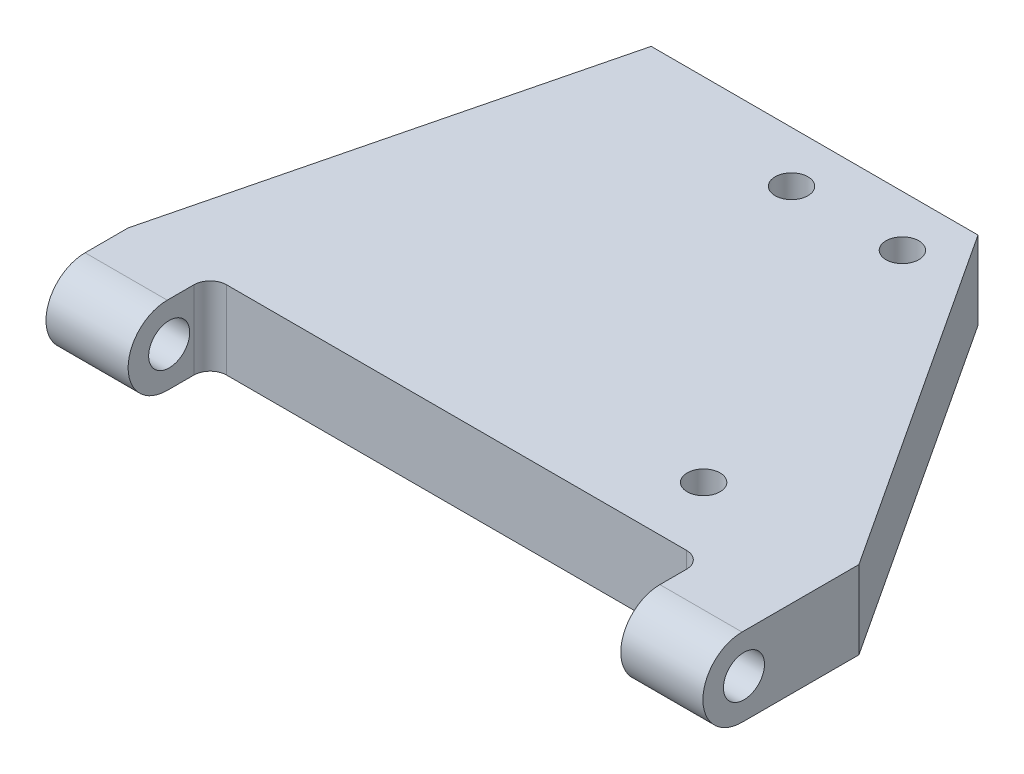
ISO-10303-21;
HEADER;
FILE_DESCRIPTION(('STEP AP214'),'2;1');
FILE_NAME('part.step','',(''),(''),'','','');
FILE_SCHEMA(('AUTOMOTIVE_DESIGN { 1 0 10303 214 1 1 1 1 }'));
ENDSEC;
DATA;
#1=APPLICATION_CONTEXT('core data for automotive mechanical design processes');
#2=APPLICATION_PROTOCOL_DEFINITION('international standard','automotive_design',2000,#1);
#3=PRODUCT_CONTEXT('',#1,'mechanical');
#4=PRODUCT('Part','Part','',(#3));
#5=PRODUCT_RELATED_PRODUCT_CATEGORY('part','',(#4));
#6=PRODUCT_DEFINITION_FORMATION('','',#4);
#7=PRODUCT_DEFINITION_CONTEXT('part definition',#1,'design');
#8=PRODUCT_DEFINITION('design','',#6,#7);
#9=PRODUCT_DEFINITION_SHAPE('','',#8);
#10=(LENGTH_UNIT() NAMED_UNIT(*) SI_UNIT(.MILLI.,.METRE.));
#11=(NAMED_UNIT(*) PLANE_ANGLE_UNIT() SI_UNIT($,.RADIAN.));
#12=(NAMED_UNIT(*) SI_UNIT($,.STERADIAN.) SOLID_ANGLE_UNIT());
#13=UNCERTAINTY_MEASURE_WITH_UNIT(LENGTH_MEASURE(1.E-05),#10,'distance_accuracy_value','');
#14=(GEOMETRIC_REPRESENTATION_CONTEXT(3) GLOBAL_UNCERTAINTY_ASSIGNED_CONTEXT((#13)) GLOBAL_UNIT_ASSIGNED_CONTEXT((#10,
#11,#12)) REPRESENTATION_CONTEXT('',''));
#15=CARTESIAN_POINT('',(0.,0.,0.));
#16=DIRECTION('',(0.,0.,1.));
#17=DIRECTION('',(1.,0.,0.));
#18=AXIS2_PLACEMENT_3D('',#15,#16,#17);
#19=CARTESIAN_POINT('',(140.,9.525,112.475));
#20=DIRECTION('',(1.,0.,0.));
#21=DIRECTION('',(0.,0.,-1.));
#22=AXIS2_PLACEMENT_3D('',#19,#20,#21);
#23=CYLINDRICAL_SURFACE('',#22,9.525);
#24=DIRECTION('',(-1.,0.,0.));
#25=VECTOR('',#24,1.);
#26=CARTESIAN_POINT('',(140.,19.05,112.475));
#27=LINE('',#26,#25);
#28=CARTESIAN_POINT('',(140.,19.05,112.475));
#29=VERTEX_POINT('',#28);
#30=CARTESIAN_POINT('',(160.,19.05,112.475));
#31=VERTEX_POINT('',#30);
#32=EDGE_CURVE('E295',#29,#31,#27,.F.);
#33=ORIENTED_EDGE('',*,*,#32,.F.);
#34=CARTESIAN_POINT('',(140.,9.525,112.475));
#35=DIRECTION('',(1.,0.,0.));
#36=DIRECTION('',(0.,0.,-1.));
#37=AXIS2_PLACEMENT_3D('',#34,#35,#36);
#38=CIRCLE('',#37,9.525);
#39=CARTESIAN_POINT('',(140.,0.,112.475));
#40=VERTEX_POINT('',#39);
#41=EDGE_CURVE('E120',#40,#29,#38,.F.);
#42=ORIENTED_EDGE('',*,*,#41,.F.);
#43=DIRECTION('',(1.,0.,0.));
#44=VECTOR('',#43,1.);
#45=CARTESIAN_POINT('',(0.,0.,112.475));
#46=LINE('',#45,#44);
#47=CARTESIAN_POINT('',(160.,0.,112.475));
#48=VERTEX_POINT('',#47);
#49=EDGE_CURVE('E298',#48,#40,#46,.F.);
#50=ORIENTED_EDGE('',*,*,#49,.F.);
#51=CARTESIAN_POINT('',(160.,9.525,112.475));
#52=DIRECTION('',(-1.,0.,0.));
#53=DIRECTION('',(0.,0.,1.));
#54=AXIS2_PLACEMENT_3D('',#51,#52,#53);
#55=CIRCLE('',#54,9.525);
#56=EDGE_CURVE('E12',#31,#48,#55,.F.);
#57=ORIENTED_EDGE('',*,*,#56,.F.);
#58=EDGE_LOOP('',(#33,#42,#50,#57));
#59=FACE_BOUND('',#58,.T.);
#60=ADVANCED_FACE('F112',(#59),#23,.T.);
#61=CARTESIAN_POINT('',(0.,9.525,112.475));
#62=DIRECTION('',(1.,0.,0.));
#63=DIRECTION('',(0.,0.,-1.));
#64=AXIS2_PLACEMENT_3D('',#61,#62,#63);
#65=CYLINDRICAL_SURFACE('',#64,9.525);
#66=DIRECTION('',(-1.,0.,0.));
#67=VECTOR('',#66,1.);
#68=CARTESIAN_POINT('',(0.,19.05,112.475));
#69=LINE('',#68,#67);
#70=CARTESIAN_POINT('',(0.,19.05,112.475));
#71=VERTEX_POINT('',#70);
#72=CARTESIAN_POINT('',(20.,19.05,112.475));
#73=VERTEX_POINT('',#72);
#74=EDGE_CURVE('E209',#71,#73,#69,.F.);
#75=ORIENTED_EDGE('',*,*,#74,.F.);
#76=CARTESIAN_POINT('',(0.,9.525,112.475));
#77=DIRECTION('',(1.,0.,0.));
#78=DIRECTION('',(0.,0.,-1.));
#79=AXIS2_PLACEMENT_3D('',#76,#77,#78);
#80=CIRCLE('',#79,9.525);
#81=CARTESIAN_POINT('',(0.,0.,112.475));
#82=VERTEX_POINT('',#81);
#83=EDGE_CURVE('E291',#82,#71,#80,.F.);
#84=ORIENTED_EDGE('',*,*,#83,.F.);
#85=DIRECTION('',(1.,0.,0.));
#86=VECTOR('',#85,1.);
#87=CARTESIAN_POINT('',(0.,0.,112.475));
#88=LINE('',#87,#86);
#89=CARTESIAN_POINT('',(20.,0.,112.475));
#90=VERTEX_POINT('',#89);
#91=EDGE_CURVE('E288',#90,#82,#88,.F.);
#92=ORIENTED_EDGE('',*,*,#91,.F.);
#93=CARTESIAN_POINT('',(20.,9.525,112.475));
#94=DIRECTION('',(1.,0.,0.));
#95=DIRECTION('',(0.,0.,-1.));
#96=AXIS2_PLACEMENT_3D('',#93,#94,#95);
#97=CIRCLE('',#96,9.525);
#98=EDGE_CURVE('E293',#73,#90,#97,.T.);
#99=ORIENTED_EDGE('',*,*,#98,.F.);
#100=EDGE_LOOP('',(#75,#84,#92,#99));
#101=FACE_BOUND('',#100,.T.);
#102=ADVANCED_FACE('F333',(#101),#65,.T.);
#103=CARTESIAN_POINT('',(0.,0.,0.));
#104=DIRECTION('',(0.,1.,0.));
#105=DIRECTION('',(0.,0.,1.));
#106=AXIS2_PLACEMENT_3D('',#103,#104,#105);
#107=PLANE('',#106);
#108=CARTESIAN_POINT('',(123.750569229122,0.,85.5773374277373));
#109=DIRECTION('',(0.,1.,0.));
#110=DIRECTION('',(0.,0.,1.));
#111=AXIS2_PLACEMENT_3D('',#108,#109,#110);
#112=CIRCLE('',#111,3.99999999999995);
#113=CARTESIAN_POINT('',(123.750569229122,0.,89.5773374277373));
#114=VERTEX_POINT('',#113);
#115=EDGE_CURVE('E438',#114,#114,#112,.T.);
#116=ORIENTED_EDGE('',*,*,#115,.T.);
#117=EDGE_LOOP('',(#116));
#118=FACE_BOUND('',#117,.T.);
#119=CARTESIAN_POINT('',(72.,0.,12.4141568321594));
#120=DIRECTION('',(0.,-1.,0.));
#121=DIRECTION('',(0.,0.,-1.));
#122=AXIS2_PLACEMENT_3D('',#119,#120,#121);
#123=CIRCLE('',#122,4.00000000000001);
#124=CARTESIAN_POINT('',(72.,0.,8.41415683215943));
#125=VERTEX_POINT('',#124);
#126=EDGE_CURVE('E447',#125,#125,#123,.T.);
#127=ORIENTED_EDGE('',*,*,#126,.F.);
#128=EDGE_LOOP('',(#127));
#129=FACE_BOUND('',#128,.T.);
#130=CARTESIAN_POINT('',(99.,0.,12.4141568321594));
#131=DIRECTION('',(0.,-1.,0.));
#132=DIRECTION('',(0.,0.,-1.));
#133=AXIS2_PLACEMENT_3D('',#130,#131,#132);
#134=CIRCLE('',#133,4.00000000000001);
#135=CARTESIAN_POINT('',(99.,0.,8.41415683215943));
#136=VERTEX_POINT('',#135);
#137=EDGE_CURVE('E397',#136,#136,#134,.T.);
#138=ORIENTED_EDGE('',*,*,#137,.F.);
#139=EDGE_LOOP('',(#138));
#140=FACE_BOUND('',#139,.T.);
#141=DIRECTION('',(0.,0.,-1.));
#142=VECTOR('',#141,1.);
#143=CARTESIAN_POINT('',(160.,0.,1.1686558153949E-13));
#144=LINE('',#143,#142);
#145=CARTESIAN_POINT('',(160.,0.,84.));
#146=VERTEX_POINT('',#145);
#147=EDGE_CURVE('E257',#48,#146,#144,.T.);
#148=ORIENTED_EDGE('',*,*,#147,.F.);
#149=ORIENTED_EDGE('',*,*,#49,.T.);
#150=DIRECTION('',(0.,0.,1.));
#151=VECTOR('',#150,1.);
#152=CARTESIAN_POINT('',(140.,0.,2.42861286636753E-13));
#153=LINE('',#152,#151);
#154=CARTESIAN_POINT('',(140.,0.,106.));
#155=VERTEX_POINT('',#154);
#156=EDGE_CURVE('E254',#155,#40,#153,.T.);
#157=ORIENTED_EDGE('',*,*,#156,.F.);
#158=CARTESIAN_POINT('',(136.,0.,106.));
#159=DIRECTION('',(0.,1.,0.));
#160=DIRECTION('',(0.,0.,1.));
#161=AXIS2_PLACEMENT_3D('',#158,#159,#160);
#162=CIRCLE('',#161,4.00000000000001);
#163=CARTESIAN_POINT('',(136.,0.,102.));
#164=VERTEX_POINT('',#163);
#165=EDGE_CURVE('E251',#164,#155,#162,.F.);
#166=ORIENTED_EDGE('',*,*,#165,.F.);
#167=DIRECTION('',(-1.,0.,0.));
#168=VECTOR('',#167,1.);
#169=CARTESIAN_POINT('',(0.,0.,102.));
#170=LINE('',#169,#168);
#171=CARTESIAN_POINT('',(24.,0.,102.));
#172=VERTEX_POINT('',#171);
#173=EDGE_CURVE('E248',#164,#172,#170,.T.);
#174=ORIENTED_EDGE('',*,*,#173,.T.);
#175=CARTESIAN_POINT('',(24.,0.,106.));
#176=DIRECTION('',(0.,1.,0.));
#177=DIRECTION('',(0.,0.,1.));
#178=AXIS2_PLACEMENT_3D('',#175,#176,#177);
#179=CIRCLE('',#178,4.00000000000001);
#180=CARTESIAN_POINT('',(20.,0.,106.));
#181=VERTEX_POINT('',#180);
#182=EDGE_CURVE('E204',#172,#181,#179,.T.);
#183=ORIENTED_EDGE('',*,*,#182,.T.);
#184=DIRECTION('',(0.,0.,1.));
#185=VECTOR('',#184,1.);
#186=CARTESIAN_POINT('',(20.,0.,0.));
#187=LINE('',#186,#185);
#188=EDGE_CURVE('E221',#181,#90,#187,.T.);
#189=ORIENTED_EDGE('',*,*,#188,.T.);
#190=ORIENTED_EDGE('',*,*,#91,.T.);
#191=DIRECTION('',(0.,0.,1.));
#192=VECTOR('',#191,1.);
#193=CARTESIAN_POINT('',(0.,0.,0.));
#194=LINE('',#193,#192);
#195=CARTESIAN_POINT('',(0.,0.,102.));
#196=VERTEX_POINT('',#195);
#197=EDGE_CURVE('E268',#196,#82,#194,.T.);
#198=ORIENTED_EDGE('',*,*,#197,.F.);
#199=DIRECTION('',(0.241640143717287,0.,-0.97036593146312));
#200=VECTOR('',#199,1.);
#201=CARTESIAN_POINT('',(23.9168950399849,0.,5.95577582368252));
#202=LINE('',#201,#200);
#203=CARTESIAN_POINT('',(25.4,0.,0.));
#204=VERTEX_POINT('',#203);
#205=EDGE_CURVE('E265',#196,#204,#202,.T.);
#206=ORIENTED_EDGE('',*,*,#205,.T.);
#207=DIRECTION('',(-1.,0.,0.));
#208=VECTOR('',#207,1.);
#209=CARTESIAN_POINT('',(0.,0.,0.));
#210=LINE('',#209,#208);
#211=CARTESIAN_POINT('',(105.,0.,0.));
#212=VERTEX_POINT('',#211);
#213=EDGE_CURVE('E262',#212,#204,#210,.T.);
#214=ORIENTED_EDGE('',*,*,#213,.F.);
#215=DIRECTION('',(0.547785941363776,0.,0.836618528628312));
#216=VECTOR('',#215,1.);
#217=CARTESIAN_POINT('',(73.4927090566412,0.,-48.1202261680389));
#218=LINE('',#217,#216);
#219=EDGE_CURVE('E259',#212,#146,#218,.T.);
#220=ORIENTED_EDGE('',*,*,#219,.T.);
#221=EDGE_LOOP('',(#148,#149,#157,#166,#174,#183,#189,#190,#198,#206,#214,#220));
#222=FACE_BOUND('',#221,.T.);
#223=ADVANCED_FACE('F307',(#118,#129,#140,#222),#107,.F.);
#224=CARTESIAN_POINT('',(140.,19.05,2.42861286636753E-13));
#225=DIRECTION('',(1.,0.,0.));
#226=DIRECTION('',(0.,0.,-1.));
#227=AXIS2_PLACEMENT_3D('',#224,#225,#226);
#228=PLANE('',#227);
#229=CARTESIAN_POINT('',(140.,9.525,112.));
#230=DIRECTION('',(1.,0.,0.));
#231=DIRECTION('',(0.,0.,-1.));
#232=AXIS2_PLACEMENT_3D('',#229,#230,#231);
#233=CIRCLE('',#232,5.);
#234=CARTESIAN_POINT('',(140.,9.525,107.));
#235=VERTEX_POINT('',#234);
#236=EDGE_CURVE('E391',#235,#235,#233,.T.);
#237=ORIENTED_EDGE('',*,*,#236,.T.);
#238=EDGE_LOOP('',(#237));
#239=FACE_BOUND('',#238,.T.);
#240=ORIENTED_EDGE('',*,*,#156,.T.);
#241=ORIENTED_EDGE('',*,*,#41,.T.);
#242=DIRECTION('',(0.,0.,1.));
#243=VECTOR('',#242,1.);
#244=CARTESIAN_POINT('',(140.,19.05,2.42861286636753E-13));
#245=LINE('',#244,#243);
#246=CARTESIAN_POINT('',(140.,19.05,106.));
#247=VERTEX_POINT('',#246);
#248=EDGE_CURVE('E227',#247,#29,#245,.T.);
#249=ORIENTED_EDGE('',*,*,#248,.F.);
#250=DIRECTION('',(0.,-1.,0.));
#251=VECTOR('',#250,1.);
#252=CARTESIAN_POINT('',(140.,19.05,106.));
#253=LINE('',#252,#251);
#254=EDGE_CURVE('E283',#247,#155,#253,.T.);
#255=ORIENTED_EDGE('',*,*,#254,.T.);
#256=EDGE_LOOP('',(#240,#241,#249,#255));
#257=FACE_BOUND('',#256,.T.);
#258=ADVANCED_FACE('F300',(#239,#257),#228,.F.);
#259=CARTESIAN_POINT('',(136.,19.05,106.));
#260=DIRECTION('',(0.,-1.,0.));
#261=DIRECTION('',(0.,0.,-1.));
#262=AXIS2_PLACEMENT_3D('',#259,#260,#261);
#263=CYLINDRICAL_SURFACE('',#262,4.00000000000001);
#264=ORIENTED_EDGE('',*,*,#165,.T.);
#265=ORIENTED_EDGE('',*,*,#254,.F.);
#266=CARTESIAN_POINT('',(136.,19.05,106.));
#267=DIRECTION('',(0.,1.,0.));
#268=DIRECTION('',(0.,0.,1.));
#269=AXIS2_PLACEMENT_3D('',#266,#267,#268);
#270=CIRCLE('',#269,4.00000000000001);
#271=CARTESIAN_POINT('',(136.,19.05,102.));
#272=VERTEX_POINT('',#271);
#273=EDGE_CURVE('E225',#272,#247,#270,.F.);
#274=ORIENTED_EDGE('',*,*,#273,.F.);
#275=DIRECTION('',(0.,-1.,0.));
#276=VECTOR('',#275,1.);
#277=CARTESIAN_POINT('',(136.,19.05,102.));
#278=LINE('',#277,#276);
#279=EDGE_CURVE('E210',#272,#164,#278,.T.);
#280=ORIENTED_EDGE('',*,*,#279,.T.);
#281=EDGE_LOOP('',(#264,#265,#274,#280));
#282=FACE_BOUND('',#281,.T.);
#283=ADVANCED_FACE('F303',(#282),#263,.F.);
#284=CARTESIAN_POINT('',(0.,19.05,102.));
#285=DIRECTION('',(0.,0.,1.));
#286=DIRECTION('',(1.,0.,0.));
#287=AXIS2_PLACEMENT_3D('',#284,#285,#286);
#288=PLANE('',#287);
#289=ORIENTED_EDGE('',*,*,#173,.F.);
#290=ORIENTED_EDGE('',*,*,#279,.F.);
#291=DIRECTION('',(-1.,0.,0.));
#292=VECTOR('',#291,1.);
#293=CARTESIAN_POINT('',(0.,19.05,102.));
#294=LINE('',#293,#292);
#295=CARTESIAN_POINT('',(24.,19.05,102.));
#296=VERTEX_POINT('',#295);
#297=EDGE_CURVE('E217',#272,#296,#294,.T.);
#298=ORIENTED_EDGE('',*,*,#297,.T.);
#299=DIRECTION('',(0.,-1.,0.));
#300=VECTOR('',#299,1.);
#301=CARTESIAN_POINT('',(24.,19.05,102.));
#302=LINE('',#301,#300);
#303=EDGE_CURVE('E198',#296,#172,#302,.T.);
#304=ORIENTED_EDGE('',*,*,#303,.T.);
#305=EDGE_LOOP('',(#289,#290,#298,#304));
#306=FACE_BOUND('',#305,.T.);
#307=ADVANCED_FACE('F223',(#306),#288,.T.);
#308=CARTESIAN_POINT('',(24.,19.05,106.));
#309=DIRECTION('',(0.,-1.,0.));
#310=DIRECTION('',(0.,0.,-1.));
#311=AXIS2_PLACEMENT_3D('',#308,#309,#310);
#312=CYLINDRICAL_SURFACE('',#311,4.00000000000001);
#313=ORIENTED_EDGE('',*,*,#182,.F.);
#314=ORIENTED_EDGE('',*,*,#303,.F.);
#315=CARTESIAN_POINT('',(24.,19.05,106.));
#316=DIRECTION('',(0.,1.,0.));
#317=DIRECTION('',(0.,0.,1.));
#318=AXIS2_PLACEMENT_3D('',#315,#316,#317);
#319=CIRCLE('',#318,4.00000000000001);
#320=CARTESIAN_POINT('',(20.,19.05,106.));
#321=VERTEX_POINT('',#320);
#322=EDGE_CURVE('E201',#296,#321,#319,.T.);
#323=ORIENTED_EDGE('',*,*,#322,.T.);
#324=DIRECTION('',(0.,-1.,0.));
#325=VECTOR('',#324,1.);
#326=CARTESIAN_POINT('',(20.,19.05,106.));
#327=LINE('',#326,#325);
#328=EDGE_CURVE('E246',#321,#181,#327,.T.);
#329=ORIENTED_EDGE('',*,*,#328,.T.);
#330=EDGE_LOOP('',(#313,#314,#323,#329));
#331=FACE_BOUND('',#330,.T.);
#332=ADVANCED_FACE('F200',(#331),#312,.F.);
#333=CARTESIAN_POINT('',(20.,19.05,0.));
#334=DIRECTION('',(1.,0.,0.));
#335=DIRECTION('',(0.,0.,-1.));
#336=AXIS2_PLACEMENT_3D('',#333,#334,#335);
#337=PLANE('',#336);
#338=CARTESIAN_POINT('',(20.,9.525,112.));
#339=DIRECTION('',(1.,0.,0.));
#340=DIRECTION('',(0.,0.,-1.));
#341=AXIS2_PLACEMENT_3D('',#338,#339,#340);
#342=CIRCLE('',#341,5.);
#343=CARTESIAN_POINT('',(20.,9.525,107.));
#344=VERTEX_POINT('',#343);
#345=EDGE_CURVE('E387',#344,#344,#342,.T.);
#346=ORIENTED_EDGE('',*,*,#345,.F.);
#347=EDGE_LOOP('',(#346));
#348=FACE_BOUND('',#347,.T.);
#349=DIRECTION('',(0.,0.,1.));
#350=VECTOR('',#349,1.);
#351=CARTESIAN_POINT('',(20.,19.05,0.));
#352=LINE('',#351,#350);
#353=EDGE_CURVE('E220',#321,#73,#352,.T.);
#354=ORIENTED_EDGE('',*,*,#353,.T.);
#355=ORIENTED_EDGE('',*,*,#98,.T.);
#356=ORIENTED_EDGE('',*,*,#188,.F.);
#357=ORIENTED_EDGE('',*,*,#328,.F.);
#358=EDGE_LOOP('',(#354,#355,#356,#357));
#359=FACE_BOUND('',#358,.T.);
#360=ADVANCED_FACE('F330',(#348,#359),#337,.T.);
#361=CARTESIAN_POINT('',(0.,19.05,0.));
#362=DIRECTION('',(1.,0.,0.));
#363=DIRECTION('',(0.,0.,-1.));
#364=AXIS2_PLACEMENT_3D('',#361,#362,#363);
#365=PLANE('',#364);
#366=CARTESIAN_POINT('',(0.,9.525,112.));
#367=DIRECTION('',(-1.,0.,0.));
#368=DIRECTION('',(0.,0.,1.));
#369=AXIS2_PLACEMENT_3D('',#366,#367,#368);
#370=CIRCLE('',#369,5.);
#371=CARTESIAN_POINT('',(0.,9.525,117.));
#372=VERTEX_POINT('',#371);
#373=EDGE_CURVE('E388',#372,#372,#370,.T.);
#374=ORIENTED_EDGE('',*,*,#373,.F.);
#375=EDGE_LOOP('',(#374));
#376=FACE_BOUND('',#375,.T.);
#377=ORIENTED_EDGE('',*,*,#197,.T.);
#378=ORIENTED_EDGE('',*,*,#83,.T.);
#379=DIRECTION('',(0.,0.,1.));
#380=VECTOR('',#379,1.);
#381=CARTESIAN_POINT('',(0.,19.05,0.));
#382=LINE('',#381,#380);
#383=CARTESIAN_POINT('',(0.,19.05,102.));
#384=VERTEX_POINT('',#383);
#385=EDGE_CURVE('E242',#384,#71,#382,.T.);
#386=ORIENTED_EDGE('',*,*,#385,.F.);
#387=DIRECTION('',(0.,-1.,0.));
#388=VECTOR('',#387,1.);
#389=CARTESIAN_POINT('',(0.,19.05,102.));
#390=LINE('',#389,#388);
#391=EDGE_CURVE('E274',#384,#196,#390,.T.);
#392=ORIENTED_EDGE('',*,*,#391,.T.);
#393=EDGE_LOOP('',(#377,#378,#386,#392));
#394=FACE_BOUND('',#393,.T.);
#395=ADVANCED_FACE('F326',(#376,#394),#365,.F.);
#396=CARTESIAN_POINT('',(23.9168950399849,19.05,5.95577582368252));
#397=DIRECTION('',(-0.97036593146312,0.,-0.241640143717287));
#398=DIRECTION('',(-0.241640143717287,0.,0.97036593146312));
#399=AXIS2_PLACEMENT_3D('',#396,#397,#398);
#400=PLANE('',#399);
#401=ORIENTED_EDGE('',*,*,#205,.F.);
#402=ORIENTED_EDGE('',*,*,#391,.F.);
#403=DIRECTION('',(0.241640143717287,0.,-0.97036593146312));
#404=VECTOR('',#403,1.);
#405=CARTESIAN_POINT('',(23.9168950399849,19.05,5.95577582368252));
#406=LINE('',#405,#404);
#407=CARTESIAN_POINT('',(25.4,19.05,0.));
#408=VERTEX_POINT('',#407);
#409=EDGE_CURVE('E239',#384,#408,#406,.T.);
#410=ORIENTED_EDGE('',*,*,#409,.T.);
#411=DIRECTION('',(0.,-1.,0.));
#412=VECTOR('',#411,1.);
#413=CARTESIAN_POINT('',(25.4,19.05,0.));
#414=LINE('',#413,#412);
#415=EDGE_CURVE('E276',#408,#204,#414,.T.);
#416=ORIENTED_EDGE('',*,*,#415,.T.);
#417=EDGE_LOOP('',(#401,#402,#410,#416));
#418=FACE_BOUND('',#417,.T.);
#419=ADVANCED_FACE('F322',(#418),#400,.T.);
#420=CARTESIAN_POINT('',(0.,19.05,0.));
#421=DIRECTION('',(0.,0.,1.));
#422=DIRECTION('',(1.,0.,0.));
#423=AXIS2_PLACEMENT_3D('',#420,#421,#422);
#424=PLANE('',#423);
#425=CARTESIAN_POINT('',(34.925,9.525,0.));
#426=DIRECTION('',(0.,0.,-1.));
#427=DIRECTION('',(-1.,0.,0.));
#428=AXIS2_PLACEMENT_3D('',#425,#426,#427);
#429=CIRCLE('',#428,3.96875);
#430=CARTESIAN_POINT('',(30.95625,9.525,0.));
#431=VERTEX_POINT('',#430);
#432=EDGE_CURVE('E401',#431,#431,#429,.T.);
#433=ORIENTED_EDGE('',*,*,#432,.F.);
#434=EDGE_LOOP('',(#433));
#435=FACE_BOUND('',#434,.T.);
#436=ORIENTED_EDGE('',*,*,#213,.T.);
#437=ORIENTED_EDGE('',*,*,#415,.F.);
#438=DIRECTION('',(-1.,0.,0.));
#439=VECTOR('',#438,1.);
#440=CARTESIAN_POINT('',(0.,19.05,0.));
#441=LINE('',#440,#439);
#442=CARTESIAN_POINT('',(105.,19.05,0.));
#443=VERTEX_POINT('',#442);
#444=EDGE_CURVE('E237',#443,#408,#441,.T.);
#445=ORIENTED_EDGE('',*,*,#444,.F.);
#446=DIRECTION('',(0.,-1.,0.));
#447=VECTOR('',#446,1.);
#448=CARTESIAN_POINT('',(105.,19.05,0.));
#449=LINE('',#448,#447);
#450=EDGE_CURVE('E278',#443,#212,#449,.T.);
#451=ORIENTED_EDGE('',*,*,#450,.T.);
#452=EDGE_LOOP('',(#436,#437,#445,#451));
#453=FACE_BOUND('',#452,.T.);
#454=ADVANCED_FACE('F319',(#435,#453),#424,.F.);
#455=CARTESIAN_POINT('',(73.4927090566412,19.05,-48.1202261680389));
#456=DIRECTION('',(0.836618528628312,0.,-0.547785941363776));
#457=DIRECTION('',(-0.547785941363776,0.,-0.836618528628312));
#458=AXIS2_PLACEMENT_3D('',#455,#456,#457);
#459=PLANE('',#458);
#460=ORIENTED_EDGE('',*,*,#219,.F.);
#461=ORIENTED_EDGE('',*,*,#450,.F.);
#462=DIRECTION('',(0.547785941363776,0.,0.836618528628312));
#463=VECTOR('',#462,1.);
#464=CARTESIAN_POINT('',(73.4927090566412,19.05,-48.1202261680389));
#465=LINE('',#464,#463);
#466=CARTESIAN_POINT('',(160.,19.05,84.));
#467=VERTEX_POINT('',#466);
#468=EDGE_CURVE('E234',#443,#467,#465,.T.);
#469=ORIENTED_EDGE('',*,*,#468,.T.);
#470=DIRECTION('',(0.,-1.,0.));
#471=VECTOR('',#470,1.);
#472=CARTESIAN_POINT('',(160.,19.05,84.));
#473=LINE('',#472,#471);
#474=EDGE_CURVE('E280',#467,#146,#473,.T.);
#475=ORIENTED_EDGE('',*,*,#474,.T.);
#476=EDGE_LOOP('',(#460,#461,#469,#475));
#477=FACE_BOUND('',#476,.T.);
#478=ADVANCED_FACE('F313',(#477),#459,.T.);
#479=CARTESIAN_POINT('',(160.,19.05,1.1686558153949E-13));
#480=DIRECTION('',(-1.,0.,0.));
#481=DIRECTION('',(0.,0.,1.));
#482=AXIS2_PLACEMENT_3D('',#479,#480,#481);
#483=PLANE('',#482);
#484=CARTESIAN_POINT('',(160.,9.525,112.));
#485=DIRECTION('',(-1.,0.,0.));
#486=DIRECTION('',(0.,0.,1.));
#487=AXIS2_PLACEMENT_3D('',#484,#485,#486);
#488=CIRCLE('',#487,5.);
#489=CARTESIAN_POINT('',(160.,9.525,117.));
#490=VERTEX_POINT('',#489);
#491=EDGE_CURVE('E385',#490,#490,#488,.T.);
#492=ORIENTED_EDGE('',*,*,#491,.T.);
#493=EDGE_LOOP('',(#492));
#494=FACE_BOUND('',#493,.T.);
#495=DIRECTION('',(0.,0.,-1.));
#496=VECTOR('',#495,1.);
#497=CARTESIAN_POINT('',(160.,19.05,1.1686558153949E-13));
#498=LINE('',#497,#496);
#499=EDGE_CURVE('E232',#31,#467,#498,.T.);
#500=ORIENTED_EDGE('',*,*,#499,.F.);
#501=ORIENTED_EDGE('',*,*,#56,.T.);
#502=ORIENTED_EDGE('',*,*,#147,.T.);
#503=ORIENTED_EDGE('',*,*,#474,.F.);
#504=EDGE_LOOP('',(#500,#501,#502,#503));
#505=FACE_BOUND('',#504,.T.);
#506=ADVANCED_FACE('F311',(#494,#505),#483,.F.);
#507=CARTESIAN_POINT('',(0.,19.05,0.));
#508=DIRECTION('',(0.,1.,0.));
#509=DIRECTION('',(0.,0.,1.));
#510=AXIS2_PLACEMENT_3D('',#507,#508,#509);
#511=PLANE('',#510);
#512=CARTESIAN_POINT('',(123.750569229122,19.05,85.5773374277373));
#513=DIRECTION('',(0.,1.,0.));
#514=DIRECTION('',(0.,0.,1.));
#515=AXIS2_PLACEMENT_3D('',#512,#513,#514);
#516=CIRCLE('',#515,3.99999999999995);
#517=CARTESIAN_POINT('',(123.750569229122,19.05,89.5773374277373));
#518=VERTEX_POINT('',#517);
#519=EDGE_CURVE('E441',#518,#518,#516,.T.);
#520=ORIENTED_EDGE('',*,*,#519,.F.);
#521=EDGE_LOOP('',(#520));
#522=FACE_BOUND('',#521,.T.);
#523=CARTESIAN_POINT('',(72.,19.05,12.4141568321594));
#524=DIRECTION('',(0.,-1.,0.));
#525=DIRECTION('',(0.,0.,-1.));
#526=AXIS2_PLACEMENT_3D('',#523,#524,#525);
#527=CIRCLE('',#526,4.00000000000001);
#528=CARTESIAN_POINT('',(72.,19.05,8.41415683215943));
#529=VERTEX_POINT('',#528);
#530=EDGE_CURVE('E394',#529,#529,#527,.T.);
#531=ORIENTED_EDGE('',*,*,#530,.T.);
#532=EDGE_LOOP('',(#531));
#533=FACE_BOUND('',#532,.T.);
#534=CARTESIAN_POINT('',(99.,19.05,12.4141568321594));
#535=DIRECTION('',(0.,-1.,0.));
#536=DIRECTION('',(0.,0.,-1.));
#537=AXIS2_PLACEMENT_3D('',#534,#535,#536);
#538=CIRCLE('',#537,4.00000000000001);
#539=CARTESIAN_POINT('',(99.,19.05,8.41415683215943));
#540=VERTEX_POINT('',#539);
#541=EDGE_CURVE('E449',#540,#540,#538,.T.);
#542=ORIENTED_EDGE('',*,*,#541,.T.);
#543=EDGE_LOOP('',(#542));
#544=FACE_BOUND('',#543,.T.);
#545=ORIENTED_EDGE('',*,*,#248,.T.);
#546=ORIENTED_EDGE('',*,*,#32,.T.);
#547=ORIENTED_EDGE('',*,*,#499,.T.);
#548=ORIENTED_EDGE('',*,*,#468,.F.);
#549=ORIENTED_EDGE('',*,*,#444,.T.);
#550=ORIENTED_EDGE('',*,*,#409,.F.);
#551=ORIENTED_EDGE('',*,*,#385,.T.);
#552=ORIENTED_EDGE('',*,*,#74,.T.);
#553=ORIENTED_EDGE('',*,*,#353,.F.);
#554=ORIENTED_EDGE('',*,*,#322,.F.);
#555=ORIENTED_EDGE('',*,*,#297,.F.);
#556=ORIENTED_EDGE('',*,*,#273,.T.);
#557=EDGE_LOOP('',(#545,#546,#547,#548,#549,#550,#551,#552,#553,#554,#555,#556));
#558=FACE_BOUND('',#557,.T.);
#559=ADVANCED_FACE('F215',(#522,#533,#544,#558),#511,.T.);
#560=CARTESIAN_POINT('',(34.925,9.525,38.1));
#561=DIRECTION('',(0.,0.,-1.));
#562=DIRECTION('',(-1.,0.,0.));
#563=AXIS2_PLACEMENT_3D('',#560,#561,#562);
#564=CYLINDRICAL_SURFACE('',#563,3.96875);
#565=CARTESIAN_POINT('',(34.925,9.525,38.1));
#566=DIRECTION('',(0.,0.,-1.));
#567=DIRECTION('',(-1.,0.,0.));
#568=AXIS2_PLACEMENT_3D('',#565,#566,#567);
#569=CIRCLE('',#568,3.96875);
#570=CARTESIAN_POINT('',(30.95625,9.525,38.1));
#571=VERTEX_POINT('',#570);
#572=EDGE_CURVE('E249',#571,#571,#569,.T.);
#573=CARTESIAN_POINT('',(30.95625,9.525,38.1));
#574=CARTESIAN_POINT('',(30.95625,9.525,37.703125));
#575=CARTESIAN_POINT('',(30.95625,9.525,37.30625));
#576=CARTESIAN_POINT('',(30.95625,9.525,36.5125));
#577=CARTESIAN_POINT('',(30.95625,9.525,36.115625));
#578=CARTESIAN_POINT('',(30.95625,9.525,35.321875));
#579=CARTESIAN_POINT('',(30.95625,9.525,34.925));
#580=CARTESIAN_POINT('',(30.95625,9.525,34.13125));
#581=CARTESIAN_POINT('',(30.95625,9.525,33.734375));
#582=CARTESIAN_POINT('',(30.95625,9.525,32.940625));
#583=CARTESIAN_POINT('',(30.95625,9.525,32.54375));
#584=CARTESIAN_POINT('',(30.95625,9.525,31.75));
#585=CARTESIAN_POINT('',(30.95625,9.525,31.353125));
#586=CARTESIAN_POINT('',(30.95625,9.525,30.559375));
#587=CARTESIAN_POINT('',(30.95625,9.525,30.1625));
#588=CARTESIAN_POINT('',(30.95625,9.525,29.36875));
#589=CARTESIAN_POINT('',(30.95625,9.525,28.971875));
#590=CARTESIAN_POINT('',(30.95625,9.525,28.178125));
#591=CARTESIAN_POINT('',(30.95625,9.525,27.78125));
#592=CARTESIAN_POINT('',(30.95625,9.525,26.9875));
#593=CARTESIAN_POINT('',(30.95625,9.525,26.590625));
#594=CARTESIAN_POINT('',(30.95625,9.525,25.796875));
#595=CARTESIAN_POINT('',(30.95625,9.525,25.4));
#596=CARTESIAN_POINT('',(30.95625,9.525,24.60625));
#597=CARTESIAN_POINT('',(30.95625,9.525,24.209375));
#598=CARTESIAN_POINT('',(30.95625,9.525,23.415625));
#599=CARTESIAN_POINT('',(30.95625,9.525,23.01875));
#600=CARTESIAN_POINT('',(30.95625,9.525,22.225));
#601=CARTESIAN_POINT('',(30.95625,9.525,21.828125));
#602=CARTESIAN_POINT('',(30.95625,9.525,21.034375));
#603=CARTESIAN_POINT('',(30.95625,9.525,20.6375));
#604=CARTESIAN_POINT('',(30.95625,9.525,19.84375));
#605=CARTESIAN_POINT('',(30.95625,9.525,19.446875));
#606=CARTESIAN_POINT('',(30.95625,9.525,18.653125));
#607=CARTESIAN_POINT('',(30.95625,9.525,18.25625));
#608=CARTESIAN_POINT('',(30.95625,9.525,17.4625));
#609=CARTESIAN_POINT('',(30.95625,9.525,17.065625));
#610=CARTESIAN_POINT('',(30.95625,9.525,16.271875));
#611=CARTESIAN_POINT('',(30.95625,9.525,15.875));
#612=CARTESIAN_POINT('',(30.95625,9.525,15.08125));
#613=CARTESIAN_POINT('',(30.95625,9.525,14.684375));
#614=CARTESIAN_POINT('',(30.95625,9.525,13.890625));
#615=CARTESIAN_POINT('',(30.95625,9.525,13.49375));
#616=CARTESIAN_POINT('',(30.95625,9.525,12.7));
#617=CARTESIAN_POINT('',(30.95625,9.525,12.303125));
#618=CARTESIAN_POINT('',(30.95625,9.525,11.509375));
#619=CARTESIAN_POINT('',(30.95625,9.525,11.1125));
#620=CARTESIAN_POINT('',(30.95625,9.525,10.31875));
#621=CARTESIAN_POINT('',(30.95625,9.525,9.92187499999999));
#622=CARTESIAN_POINT('',(30.95625,9.525,9.128125));
#623=CARTESIAN_POINT('',(30.95625,9.525,8.73124999999999));
#624=CARTESIAN_POINT('',(30.95625,9.525,7.93749999999999));
#625=CARTESIAN_POINT('',(30.95625,9.525,7.54062499999999));
#626=CARTESIAN_POINT('',(30.95625,9.525,6.74687499999999));
#627=CARTESIAN_POINT('',(30.95625,9.525,6.35));
#628=CARTESIAN_POINT('',(30.95625,9.525,5.55625));
#629=CARTESIAN_POINT('',(30.95625,9.525,5.159375));
#630=CARTESIAN_POINT('',(30.95625,9.525,4.365625));
#631=CARTESIAN_POINT('',(30.95625,9.525,3.96875));
#632=CARTESIAN_POINT('',(30.95625,9.525,3.17499999999999));
#633=CARTESIAN_POINT('',(30.95625,9.525,2.77812499999999));
#634=CARTESIAN_POINT('',(30.95625,9.525,1.98437499999999));
#635=CARTESIAN_POINT('',(30.95625,9.525,1.58749999999999));
#636=CARTESIAN_POINT('',(30.95625,9.525,0.793749999999994));
#637=CARTESIAN_POINT('',(30.95625,9.525,0.396874999999993));
#638=CARTESIAN_POINT('',(30.95625,9.525,0.));
#639=B_SPLINE_CURVE_WITH_KNOTS('',3,(#573,#574,#575,#576,#577,#578,#579,#580,#581,#582,#583,
#584,#585,#586,#587,#588,#589,#590,#591,#592,#593,#594,#595,#596,#597,#598,#599,#600,#601,#602,
#603,#604,#605,#606,#607,#608,#609,#610,#611,#612,#613,#614,#615,#616,#617,#618,#619,#620,#621,
#622,#623,#624,#625,#626,#627,#628,#629,#630,#631,#632,#633,#634,#635,#636,#637,#638),
.UNSPECIFIED.,.F.,.F.,(4,2,2,2,2,2,2,2,2,2,2,2,2,2,2,2,2,2,2,2,2,2,2,2,2,2,2,2,2,2,2,2,4),(0.,
1.19062499999999,2.38124999999999,3.571875,4.7625,5.953125,7.14375,8.334375,9.525,10.715625,
11.90625,13.096875,14.2875,15.478125,16.66875,17.859375,19.05,20.240625,21.43125,22.621875,
23.8125,25.003125,26.19375,27.384375,28.575,29.765625,30.95625,32.146875,33.3375,34.528125,
35.71875,36.909375,38.1),.UNSPECIFIED.);
#640=EDGE_CURVE('BSEAM381',#571,#431,#639,.T.);
#641=ORIENTED_EDGE('',*,*,#572,.F.);
#642=ORIENTED_EDGE('',*,*,#432,.T.);
#643=ORIENTED_EDGE('',*,*,#640,.T.);
#644=ORIENTED_EDGE('',*,*,#640,.F.);
#645=EDGE_LOOP('',(#641,#643,#642,#644));
#646=FACE_BOUND('',#645,.T.);
#647=ADVANCED_FACE('F381',(#646),#564,.F.);
#648=CARTESIAN_POINT('',(34.925,9.525,38.1));
#649=DIRECTION('',(0.,0.,-1.));
#650=DIRECTION('',(-1.,0.,0.));
#651=AXIS2_PLACEMENT_3D('',#648,#649,#650);
#652=PLANE('',#651);
#653=ORIENTED_EDGE('',*,*,#572,.T.);
#654=EDGE_LOOP('',(#653));
#655=FACE_BOUND('',#654,.T.);
#656=ADVANCED_FACE('F407',(#655),#652,.T.);
#657=CARTESIAN_POINT('',(160.,9.525,112.));
#658=DIRECTION('',(-1.,0.,0.));
#659=DIRECTION('',(0.,0.,1.));
#660=AXIS2_PLACEMENT_3D('',#657,#658,#659);
#661=CYLINDRICAL_SURFACE('',#660,5.);
#662=ORIENTED_EDGE('',*,*,#491,.F.);
#663=EDGE_LOOP('',(#662));
#664=FACE_BOUND('',#663,.T.);
#665=ORIENTED_EDGE('',*,*,#236,.F.);
#666=EDGE_LOOP('',(#665));
#667=FACE_BOUND('',#666,.T.);
#668=ADVANCED_FACE('F413',(#664,#667),#661,.F.);
#669=ORIENTED_EDGE('',*,*,#345,.T.);
#670=EDGE_LOOP('',(#669));
#671=FACE_BOUND('',#670,.T.);
#672=ORIENTED_EDGE('',*,*,#373,.T.);
#673=EDGE_LOOP('',(#672));
#674=FACE_BOUND('',#673,.T.);
#675=ADVANCED_FACE('F418',(#671,#674),#661,.F.);
#676=CARTESIAN_POINT('',(99.,19.05,12.4141568321594));
#677=DIRECTION('',(0.,-1.,0.));
#678=DIRECTION('',(0.,0.,-1.));
#679=AXIS2_PLACEMENT_3D('',#676,#677,#678);
#680=CYLINDRICAL_SURFACE('',#679,4.00000000000001);
#681=CARTESIAN_POINT('',(99.,19.05,8.41415683215943));
#682=CARTESIAN_POINT('',(99.,18.8515625,8.41415683215943));
#683=CARTESIAN_POINT('',(99.,18.653125,8.41415683215943));
#684=CARTESIAN_POINT('',(99.,18.25625,8.41415683215943));
#685=CARTESIAN_POINT('',(99.,18.0578125,8.41415683215943));
#686=CARTESIAN_POINT('',(99.,17.6609375,8.41415683215943));
#687=CARTESIAN_POINT('',(99.,17.4625,8.41415683215943));
#688=CARTESIAN_POINT('',(99.,17.065625,8.41415683215943));
#689=CARTESIAN_POINT('',(99.,16.8671875,8.41415683215943));
#690=CARTESIAN_POINT('',(99.,16.4703125,8.41415683215943));
#691=CARTESIAN_POINT('',(99.,16.271875,8.41415683215943));
#692=CARTESIAN_POINT('',(99.,15.875,8.41415683215943));
#693=CARTESIAN_POINT('',(99.,15.6765625,8.41415683215943));
#694=CARTESIAN_POINT('',(99.,15.2796875,8.41415683215943));
#695=CARTESIAN_POINT('',(99.,15.08125,8.41415683215943));
#696=CARTESIAN_POINT('',(99.,14.684375,8.41415683215943));
#697=CARTESIAN_POINT('',(99.,14.4859375,8.41415683215943));
#698=CARTESIAN_POINT('',(99.,14.0890625,8.41415683215943));
#699=CARTESIAN_POINT('',(99.,13.890625,8.41415683215943));
#700=CARTESIAN_POINT('',(99.,13.49375,8.41415683215943));
#701=CARTESIAN_POINT('',(99.,13.2953125,8.41415683215943));
#702=CARTESIAN_POINT('',(99.,12.8984375,8.41415683215943));
#703=CARTESIAN_POINT('',(99.,12.7,8.41415683215943));
#704=CARTESIAN_POINT('',(99.,12.303125,8.41415683215943));
#705=CARTESIAN_POINT('',(99.,12.1046875,8.41415683215943));
#706=CARTESIAN_POINT('',(99.,11.7078125,8.41415683215943));
#707=CARTESIAN_POINT('',(99.,11.509375,8.41415683215943));
#708=CARTESIAN_POINT('',(99.,11.1125,8.41415683215943));
#709=CARTESIAN_POINT('',(99.,10.9140625,8.41415683215943));
#710=CARTESIAN_POINT('',(99.,10.5171875,8.41415683215943));
#711=CARTESIAN_POINT('',(99.,10.31875,8.41415683215943));
#712=CARTESIAN_POINT('',(99.,9.921875,8.41415683215943));
#713=CARTESIAN_POINT('',(99.,9.7234375,8.41415683215943));
#714=CARTESIAN_POINT('',(99.,9.3265625,8.41415683215943));
#715=CARTESIAN_POINT('',(99.,9.128125,8.41415683215943));
#716=CARTESIAN_POINT('',(99.,8.73125,8.41415683215943));
#717=CARTESIAN_POINT('',(99.,8.5328125,8.41415683215943));
#718=CARTESIAN_POINT('',(99.,8.1359375,8.41415683215943));
#719=CARTESIAN_POINT('',(99.,7.9375,8.41415683215943));
#720=CARTESIAN_POINT('',(99.,7.540625,8.41415683215943));
#721=CARTESIAN_POINT('',(99.,7.3421875,8.41415683215943));
#722=CARTESIAN_POINT('',(99.,6.9453125,8.41415683215943));
#723=CARTESIAN_POINT('',(99.,6.746875,8.41415683215943));
#724=CARTESIAN_POINT('',(99.,6.35,8.41415683215943));
#725=CARTESIAN_POINT('',(99.,6.1515625,8.41415683215943));
#726=CARTESIAN_POINT('',(99.,5.7546875,8.41415683215943));
#727=CARTESIAN_POINT('',(99.,5.55625,8.41415683215943));
#728=CARTESIAN_POINT('',(99.,5.159375,8.41415683215943));
#729=CARTESIAN_POINT('',(99.,4.9609375,8.41415683215943));
#730=CARTESIAN_POINT('',(99.,4.5640625,8.41415683215943));
#731=CARTESIAN_POINT('',(99.,4.365625,8.41415683215943));
#732=CARTESIAN_POINT('',(99.,3.96875,8.41415683215943));
#733=CARTESIAN_POINT('',(99.,3.7703125,8.41415683215943));
#734=CARTESIAN_POINT('',(99.,3.3734375,8.41415683215943));
#735=CARTESIAN_POINT('',(99.,3.175,8.41415683215943));
#736=CARTESIAN_POINT('',(99.,2.778125,8.41415683215943));
#737=CARTESIAN_POINT('',(99.,2.5796875,8.41415683215943));
#738=CARTESIAN_POINT('',(99.,2.1828125,8.41415683215943));
#739=CARTESIAN_POINT('',(99.,1.984375,8.41415683215943));
#740=CARTESIAN_POINT('',(99.,1.5875,8.41415683215943));
#741=CARTESIAN_POINT('',(99.,1.3890625,8.41415683215943));
#742=CARTESIAN_POINT('',(99.,0.992187500000001,8.41415683215943));
#743=CARTESIAN_POINT('',(99.,0.793750000000001,8.41415683215943));
#744=CARTESIAN_POINT('',(99.,0.396875,8.41415683215943));
#745=CARTESIAN_POINT('',(99.,0.1984375,8.41415683215943));
#746=CARTESIAN_POINT('',(99.,0.,8.41415683215943));
#747=B_SPLINE_CURVE_WITH_KNOTS('',3,(#681,#682,#683,#684,#685,#686,#687,#688,#689,#690,#691,
#692,#693,#694,#695,#696,#697,#698,#699,#700,#701,#702,#703,#704,#705,#706,#707,#708,#709,#710,
#711,#712,#713,#714,#715,#716,#717,#718,#719,#720,#721,#722,#723,#724,#725,#726,#727,#728,#729,
#730,#731,#732,#733,#734,#735,#736,#737,#738,#739,#740,#741,#742,#743,#744,#745,#746),
.UNSPECIFIED.,.F.,.F.,(4,2,2,2,2,2,2,2,2,2,2,2,2,2,2,2,2,2,2,2,2,2,2,2,2,2,2,2,2,2,2,2,4),(0.,
0.5953125,1.190625,1.7859375,2.38125,2.9765625,3.571875,4.1671875,4.7625,5.3578125,5.953125,
6.5484375,7.14375,7.7390625,8.334375,8.9296875,9.525,10.1203125,10.715625,11.3109375,11.90625,
12.5015625,13.096875,13.6921875,14.2875,14.8828125,15.478125,16.0734375,16.66875,17.2640625,
17.859375,18.4546875,19.05),.UNSPECIFIED.);
#748=EDGE_CURVE('BSEAM421',#540,#136,#747,.T.);
#749=ORIENTED_EDGE('',*,*,#541,.F.);
#750=ORIENTED_EDGE('',*,*,#137,.T.);
#751=ORIENTED_EDGE('',*,*,#748,.T.);
#752=ORIENTED_EDGE('',*,*,#748,.F.);
#753=EDGE_LOOP('',(#749,#751,#750,#752));
#754=FACE_BOUND('',#753,.T.);
#755=ADVANCED_FACE('F421',(#754),#680,.F.);
#756=CARTESIAN_POINT('',(72.,19.05,12.4141568321594));
#757=DIRECTION('',(0.,-1.,0.));
#758=DIRECTION('',(0.,0.,-1.));
#759=AXIS2_PLACEMENT_3D('',#756,#757,#758);
#760=CYLINDRICAL_SURFACE('',#759,4.00000000000001);
#761=CARTESIAN_POINT('',(72.,19.05,8.41415683215943));
#762=CARTESIAN_POINT('',(72.,18.8515625,8.41415683215943));
#763=CARTESIAN_POINT('',(72.,18.653125,8.41415683215943));
#764=CARTESIAN_POINT('',(72.,18.25625,8.41415683215943));
#765=CARTESIAN_POINT('',(72.,18.0578125,8.41415683215943));
#766=CARTESIAN_POINT('',(72.,17.6609375,8.41415683215943));
#767=CARTESIAN_POINT('',(72.,17.4625,8.41415683215943));
#768=CARTESIAN_POINT('',(72.,17.065625,8.41415683215943));
#769=CARTESIAN_POINT('',(72.,16.8671875,8.41415683215943));
#770=CARTESIAN_POINT('',(72.,16.4703125,8.41415683215943));
#771=CARTESIAN_POINT('',(72.,16.271875,8.41415683215943));
#772=CARTESIAN_POINT('',(72.,15.875,8.41415683215943));
#773=CARTESIAN_POINT('',(72.,15.6765625,8.41415683215943));
#774=CARTESIAN_POINT('',(72.,15.2796875,8.41415683215943));
#775=CARTESIAN_POINT('',(72.,15.08125,8.41415683215943));
#776=CARTESIAN_POINT('',(72.,14.684375,8.41415683215943));
#777=CARTESIAN_POINT('',(72.,14.4859375,8.41415683215943));
#778=CARTESIAN_POINT('',(72.,14.0890625,8.41415683215943));
#779=CARTESIAN_POINT('',(72.,13.890625,8.41415683215943));
#780=CARTESIAN_POINT('',(72.,13.49375,8.41415683215943));
#781=CARTESIAN_POINT('',(72.,13.2953125,8.41415683215943));
#782=CARTESIAN_POINT('',(72.,12.8984375,8.41415683215943));
#783=CARTESIAN_POINT('',(72.,12.7,8.41415683215943));
#784=CARTESIAN_POINT('',(72.,12.303125,8.41415683215943));
#785=CARTESIAN_POINT('',(72.,12.1046875,8.41415683215943));
#786=CARTESIAN_POINT('',(72.,11.7078125,8.41415683215943));
#787=CARTESIAN_POINT('',(72.,11.509375,8.41415683215943));
#788=CARTESIAN_POINT('',(72.,11.1125,8.41415683215943));
#789=CARTESIAN_POINT('',(72.,10.9140625,8.41415683215943));
#790=CARTESIAN_POINT('',(72.,10.5171875,8.41415683215943));
#791=CARTESIAN_POINT('',(72.,10.31875,8.41415683215943));
#792=CARTESIAN_POINT('',(72.,9.921875,8.41415683215943));
#793=CARTESIAN_POINT('',(72.,9.7234375,8.41415683215943));
#794=CARTESIAN_POINT('',(72.,9.3265625,8.41415683215943));
#795=CARTESIAN_POINT('',(72.,9.128125,8.41415683215943));
#796=CARTESIAN_POINT('',(72.,8.73125,8.41415683215943));
#797=CARTESIAN_POINT('',(72.,8.5328125,8.41415683215943));
#798=CARTESIAN_POINT('',(72.,8.1359375,8.41415683215943));
#799=CARTESIAN_POINT('',(72.,7.9375,8.41415683215943));
#800=CARTESIAN_POINT('',(72.,7.540625,8.41415683215943));
#801=CARTESIAN_POINT('',(72.,7.3421875,8.41415683215943));
#802=CARTESIAN_POINT('',(72.,6.9453125,8.41415683215943));
#803=CARTESIAN_POINT('',(72.,6.746875,8.41415683215943));
#804=CARTESIAN_POINT('',(72.,6.35,8.41415683215943));
#805=CARTESIAN_POINT('',(72.,6.1515625,8.41415683215943));
#806=CARTESIAN_POINT('',(72.,5.7546875,8.41415683215943));
#807=CARTESIAN_POINT('',(72.,5.55625,8.41415683215943));
#808=CARTESIAN_POINT('',(72.,5.159375,8.41415683215943));
#809=CARTESIAN_POINT('',(72.,4.9609375,8.41415683215943));
#810=CARTESIAN_POINT('',(72.,4.5640625,8.41415683215943));
#811=CARTESIAN_POINT('',(72.,4.365625,8.41415683215943));
#812=CARTESIAN_POINT('',(72.,3.96875,8.41415683215943));
#813=CARTESIAN_POINT('',(72.,3.7703125,8.41415683215943));
#814=CARTESIAN_POINT('',(72.,3.3734375,8.41415683215943));
#815=CARTESIAN_POINT('',(72.,3.175,8.41415683215943));
#816=CARTESIAN_POINT('',(72.,2.778125,8.41415683215943));
#817=CARTESIAN_POINT('',(72.,2.5796875,8.41415683215943));
#818=CARTESIAN_POINT('',(72.,2.1828125,8.41415683215943));
#819=CARTESIAN_POINT('',(72.,1.984375,8.41415683215943));
#820=CARTESIAN_POINT('',(72.,1.5875,8.41415683215943));
#821=CARTESIAN_POINT('',(72.,1.3890625,8.41415683215943));
#822=CARTESIAN_POINT('',(72.,0.992187500000001,8.41415683215943));
#823=CARTESIAN_POINT('',(72.,0.793750000000001,8.41415683215943));
#824=CARTESIAN_POINT('',(72.,0.396875,8.41415683215943));
#825=CARTESIAN_POINT('',(72.,0.1984375,8.41415683215943));
#826=CARTESIAN_POINT('',(72.,0.,8.41415683215943));
#827=B_SPLINE_CURVE_WITH_KNOTS('',3,(#761,#762,#763,#764,#765,#766,#767,#768,#769,#770,#771,
#772,#773,#774,#775,#776,#777,#778,#779,#780,#781,#782,#783,#784,#785,#786,#787,#788,#789,#790,
#791,#792,#793,#794,#795,#796,#797,#798,#799,#800,#801,#802,#803,#804,#805,#806,#807,#808,#809,
#810,#811,#812,#813,#814,#815,#816,#817,#818,#819,#820,#821,#822,#823,#824,#825,#826),
.UNSPECIFIED.,.F.,.F.,(4,2,2,2,2,2,2,2,2,2,2,2,2,2,2,2,2,2,2,2,2,2,2,2,2,2,2,2,2,2,2,2,4),(0.,
0.5953125,1.190625,1.7859375,2.38125,2.9765625,3.571875,4.1671875,4.7625,5.3578125,5.953125,
6.5484375,7.14375,7.7390625,8.334375,8.9296875,9.525,10.1203125,10.715625,11.3109375,11.90625,
12.5015625,13.096875,13.6921875,14.2875,14.8828125,15.478125,16.0734375,16.66875,17.2640625,
17.859375,18.4546875,19.05),.UNSPECIFIED.);
#828=EDGE_CURVE('BSEAM425',#529,#125,#827,.T.);
#829=ORIENTED_EDGE('',*,*,#530,.F.);
#830=ORIENTED_EDGE('',*,*,#126,.T.);
#831=ORIENTED_EDGE('',*,*,#828,.T.);
#832=ORIENTED_EDGE('',*,*,#828,.F.);
#833=EDGE_LOOP('',(#829,#831,#830,#832));
#834=FACE_BOUND('',#833,.T.);
#835=ADVANCED_FACE('F425',(#834),#760,.F.);
#836=CARTESIAN_POINT('',(123.750569229122,0.,85.5773374277373));
#837=DIRECTION('',(0.,1.,0.));
#838=DIRECTION('',(0.,0.,1.));
#839=AXIS2_PLACEMENT_3D('',#836,#837,#838);
#840=CYLINDRICAL_SURFACE('',#839,3.99999999999995);
#841=CARTESIAN_POINT('',(123.750569229122,0.,89.5773374277373));
#842=CARTESIAN_POINT('',(123.750569229122,0.1984375,89.5773374277373));
#843=CARTESIAN_POINT('',(123.750569229122,0.396875,89.5773374277373));
#844=CARTESIAN_POINT('',(123.750569229122,0.79375,89.5773374277373));
#845=CARTESIAN_POINT('',(123.750569229122,0.9921875,89.5773374277373));
#846=CARTESIAN_POINT('',(123.750569229122,1.3890625,89.5773374277373));
#847=CARTESIAN_POINT('',(123.750569229122,1.5875,89.5773374277373));
#848=CARTESIAN_POINT('',(123.750569229122,1.984375,89.5773374277373));
#849=CARTESIAN_POINT('',(123.750569229122,2.1828125,89.5773374277373));
#850=CARTESIAN_POINT('',(123.750569229122,2.5796875,89.5773374277373));
#851=CARTESIAN_POINT('',(123.750569229122,2.778125,89.5773374277373));
#852=CARTESIAN_POINT('',(123.750569229122,3.175,89.5773374277373));
#853=CARTESIAN_POINT('',(123.750569229122,3.3734375,89.5773374277373));
#854=CARTESIAN_POINT('',(123.750569229122,3.7703125,89.5773374277373));
#855=CARTESIAN_POINT('',(123.750569229122,3.96875,89.5773374277373));
#856=CARTESIAN_POINT('',(123.750569229122,4.365625,89.5773374277373));
#857=CARTESIAN_POINT('',(123.750569229122,4.5640625,89.5773374277373));
#858=CARTESIAN_POINT('',(123.750569229122,4.9609375,89.5773374277373));
#859=CARTESIAN_POINT('',(123.750569229122,5.159375,89.5773374277373));
#860=CARTESIAN_POINT('',(123.750569229122,5.55625,89.5773374277373));
#861=CARTESIAN_POINT('',(123.750569229122,5.7546875,89.5773374277373));
#862=CARTESIAN_POINT('',(123.750569229122,6.1515625,89.5773374277373));
#863=CARTESIAN_POINT('',(123.750569229122,6.35,89.5773374277373));
#864=CARTESIAN_POINT('',(123.750569229122,6.746875,89.5773374277373));
#865=CARTESIAN_POINT('',(123.750569229122,6.9453125,89.5773374277373));
#866=CARTESIAN_POINT('',(123.750569229122,7.3421875,89.5773374277373));
#867=CARTESIAN_POINT('',(123.750569229122,7.540625,89.5773374277373));
#868=CARTESIAN_POINT('',(123.750569229122,7.9375,89.5773374277373));
#869=CARTESIAN_POINT('',(123.750569229122,8.1359375,89.5773374277373));
#870=CARTESIAN_POINT('',(123.750569229122,8.5328125,89.5773374277373));
#871=CARTESIAN_POINT('',(123.750569229122,8.73125,89.5773374277373));
#872=CARTESIAN_POINT('',(123.750569229122,9.128125,89.5773374277373));
#873=CARTESIAN_POINT('',(123.750569229122,9.3265625,89.5773374277373));
#874=CARTESIAN_POINT('',(123.750569229122,9.7234375,89.5773374277373));
#875=CARTESIAN_POINT('',(123.750569229122,9.921875,89.5773374277373));
#876=CARTESIAN_POINT('',(123.750569229122,10.31875,89.5773374277373));
#877=CARTESIAN_POINT('',(123.750569229122,10.5171875,89.5773374277373));
#878=CARTESIAN_POINT('',(123.750569229122,10.9140625,89.5773374277373));
#879=CARTESIAN_POINT('',(123.750569229122,11.1125,89.5773374277373));
#880=CARTESIAN_POINT('',(123.750569229122,11.509375,89.5773374277373));
#881=CARTESIAN_POINT('',(123.750569229122,11.7078125,89.5773374277373));
#882=CARTESIAN_POINT('',(123.750569229122,12.1046875,89.5773374277373));
#883=CARTESIAN_POINT('',(123.750569229122,12.303125,89.5773374277373));
#884=CARTESIAN_POINT('',(123.750569229122,12.7,89.5773374277373));
#885=CARTESIAN_POINT('',(123.750569229122,12.8984375,89.5773374277373));
#886=CARTESIAN_POINT('',(123.750569229122,13.2953125,89.5773374277373));
#887=CARTESIAN_POINT('',(123.750569229122,13.49375,89.5773374277373));
#888=CARTESIAN_POINT('',(123.750569229122,13.890625,89.5773374277373));
#889=CARTESIAN_POINT('',(123.750569229122,14.0890625,89.5773374277373));
#890=CARTESIAN_POINT('',(123.750569229122,14.4859375,89.5773374277373));
#891=CARTESIAN_POINT('',(123.750569229122,14.684375,89.5773374277373));
#892=CARTESIAN_POINT('',(123.750569229122,15.08125,89.5773374277373));
#893=CARTESIAN_POINT('',(123.750569229122,15.2796875,89.5773374277373));
#894=CARTESIAN_POINT('',(123.750569229122,15.6765625,89.5773374277373));
#895=CARTESIAN_POINT('',(123.750569229122,15.875,89.5773374277373));
#896=CARTESIAN_POINT('',(123.750569229122,16.271875,89.5773374277373));
#897=CARTESIAN_POINT('',(123.750569229122,16.4703125,89.5773374277373));
#898=CARTESIAN_POINT('',(123.750569229122,16.8671875,89.5773374277373));
#899=CARTESIAN_POINT('',(123.750569229122,17.065625,89.5773374277373));
#900=CARTESIAN_POINT('',(123.750569229122,17.4625,89.5773374277373));
#901=CARTESIAN_POINT('',(123.750569229122,17.6609375,89.5773374277373));
#902=CARTESIAN_POINT('',(123.750569229122,18.0578125,89.5773374277373));
#903=CARTESIAN_POINT('',(123.750569229122,18.25625,89.5773374277373));
#904=CARTESIAN_POINT('',(123.750569229122,18.653125,89.5773374277373));
#905=CARTESIAN_POINT('',(123.750569229122,18.8515625,89.5773374277373));
#906=CARTESIAN_POINT('',(123.750569229122,19.05,89.5773374277373));
#907=B_SPLINE_CURVE_WITH_KNOTS('',3,(#841,#842,#843,#844,#845,#846,#847,#848,#849,#850,#851,
#852,#853,#854,#855,#856,#857,#858,#859,#860,#861,#862,#863,#864,#865,#866,#867,#868,#869,#870,
#871,#872,#873,#874,#875,#876,#877,#878,#879,#880,#881,#882,#883,#884,#885,#886,#887,#888,#889,
#890,#891,#892,#893,#894,#895,#896,#897,#898,#899,#900,#901,#902,#903,#904,#905,#906),
.UNSPECIFIED.,.F.,.F.,(4,2,2,2,2,2,2,2,2,2,2,2,2,2,2,2,2,2,2,2,2,2,2,2,2,2,2,2,2,2,2,2,4),(0.,
0.5953125,1.190625,1.7859375,2.38125,2.9765625,3.571875,4.1671875,4.7625,5.3578125,5.953125,
6.5484375,7.14375,7.7390625,8.334375,8.9296875,9.525,10.1203125,10.715625,11.3109375,11.90625,
12.5015625,13.096875,13.6921875,14.2875,14.8828125,15.478125,16.0734375,16.66875,17.2640625,
17.859375,18.4546875,19.05),.UNSPECIFIED.);
#908=EDGE_CURVE('BSEAM429',#114,#518,#907,.T.);
#909=ORIENTED_EDGE('',*,*,#115,.F.);
#910=ORIENTED_EDGE('',*,*,#519,.T.);
#911=ORIENTED_EDGE('',*,*,#908,.T.);
#912=ORIENTED_EDGE('',*,*,#908,.F.);
#913=EDGE_LOOP('',(#909,#911,#910,#912));
#914=FACE_BOUND('',#913,.T.);
#915=ADVANCED_FACE('F429',(#914),#840,.F.);
#916=CLOSED_SHELL('',(#60,#102,#223,#258,#283,#307,#332,#360,#395,#419,#454,#478,#506,#559,#647,
#656,#668,#675,#755,#835,#915));
#917=MANIFOLD_SOLID_BREP('B2',#916);
#918=ADVANCED_BREP_SHAPE_REPRESENTATION('',(#18,#917),#14);
#919=SHAPE_DEFINITION_REPRESENTATION(#9,#918);
ENDSEC;
END-ISO-10303-21;
